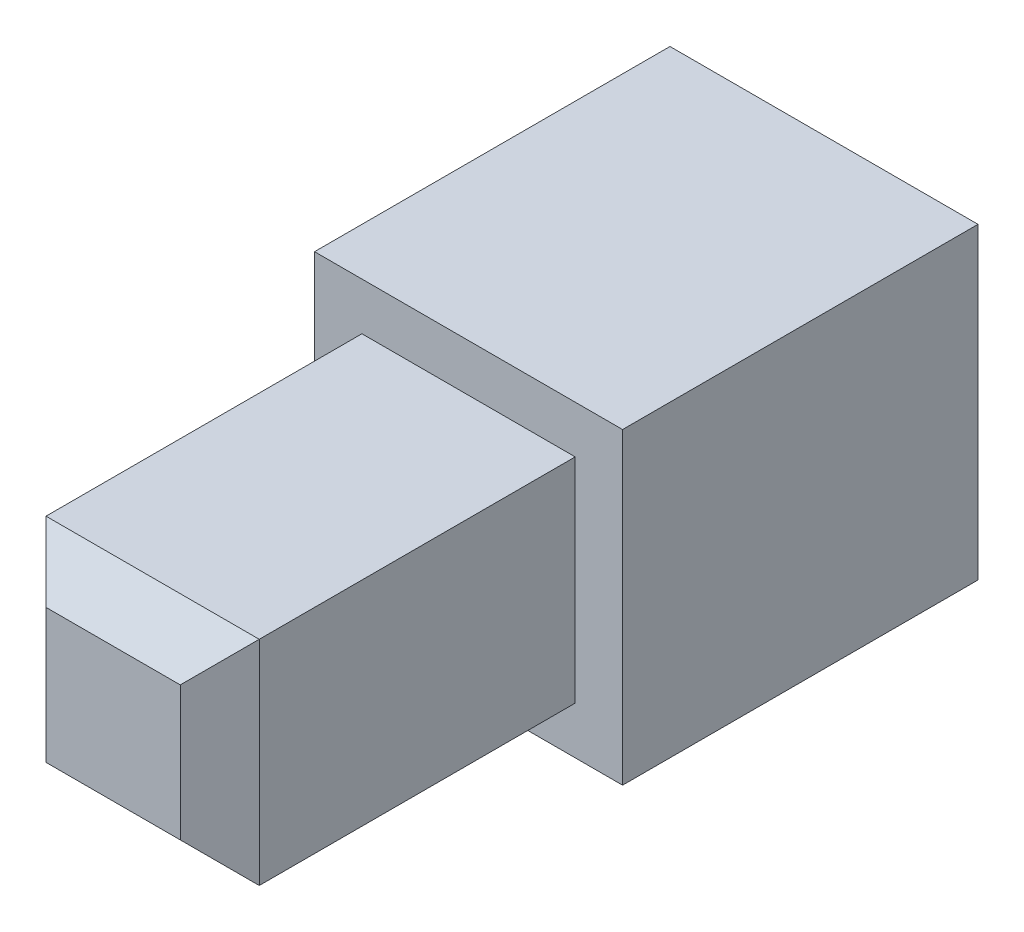
ISO-10303-21;
HEADER;
FILE_DESCRIPTION(('STEP AP214'),'2;1');
FILE_NAME('part.step','',(''),(''),'','','');
FILE_SCHEMA(('AUTOMOTIVE_DESIGN { 1 0 10303 214 1 1 1 1 }'));
ENDSEC;
DATA;
#1=APPLICATION_CONTEXT('core data for automotive mechanical design processes');
#2=APPLICATION_PROTOCOL_DEFINITION('international standard','automotive_design',2000,#1);
#3=PRODUCT_CONTEXT('',#1,'mechanical');
#4=PRODUCT('Part','Part','',(#3));
#5=PRODUCT_RELATED_PRODUCT_CATEGORY('part','',(#4));
#6=PRODUCT_DEFINITION_FORMATION('','',#4);
#7=PRODUCT_DEFINITION_CONTEXT('part definition',#1,'design');
#8=PRODUCT_DEFINITION('design','',#6,#7);
#9=PRODUCT_DEFINITION_SHAPE('','',#8);
#10=(LENGTH_UNIT() NAMED_UNIT(*) SI_UNIT(.MILLI.,.METRE.));
#11=(NAMED_UNIT(*) PLANE_ANGLE_UNIT() SI_UNIT($,.RADIAN.));
#12=(NAMED_UNIT(*) SI_UNIT($,.STERADIAN.) SOLID_ANGLE_UNIT());
#13=UNCERTAINTY_MEASURE_WITH_UNIT(LENGTH_MEASURE(1.E-05),#10,'distance_accuracy_value','');
#14=(GEOMETRIC_REPRESENTATION_CONTEXT(3) GLOBAL_UNCERTAINTY_ASSIGNED_CONTEXT((#13)) GLOBAL_UNIT_ASSIGNED_CONTEXT((#10,
#11,#12)) REPRESENTATION_CONTEXT('',''));
#15=CARTESIAN_POINT('',(0.,0.,0.));
#16=DIRECTION('',(0.,0.,1.));
#17=DIRECTION('',(1.,0.,0.));
#18=AXIS2_PLACEMENT_3D('',#15,#16,#17);
#19=CARTESIAN_POINT('',(-16.0508047809622,93.9158491987574,105.335422766237));
#20=DIRECTION('',(1.,0.,0.));
#21=DIRECTION('',(0.,0.,-1.));
#22=AXIS2_PLACEMENT_3D('',#19,#20,#21);
#23=PLANE('',#22);
#24=DIRECTION('',(0.,0.,-1.));
#25=VECTOR('',#24,1.);
#26=CARTESIAN_POINT('',(-16.0508047809622,93.9158491987574,105.335422766237));
#27=LINE('',#26,#25);
#28=CARTESIAN_POINT('',(-16.0508047809622,93.9158491987574,105.335422766237));
#29=VERTEX_POINT('',#28);
#30=CARTESIAN_POINT('',(-16.0508047809622,93.9158491987574,96.3354227662368));
#31=VERTEX_POINT('',#30);
#32=EDGE_CURVE('E216',#29,#31,#27,.T.);
#33=ORIENTED_EDGE('',*,*,#32,.T.);
#34=DIRECTION('',(0.,1.,0.));
#35=VECTOR('',#34,1.);
#36=CARTESIAN_POINT('',(-16.0508047809622,93.9158491987574,96.3354227662368));
#37=LINE('',#36,#35);
#38=CARTESIAN_POINT('',(-16.0508047809622,86.1158493894914,96.3354227662368));
#39=VERTEX_POINT('',#38);
#40=EDGE_CURVE('E204',#39,#31,#37,.T.);
#41=ORIENTED_EDGE('',*,*,#40,.F.);
#42=DIRECTION('',(0.,0.,-1.));
#43=VECTOR('',#42,1.);
#44=CARTESIAN_POINT('',(-16.0508047809622,86.1158493894914,105.335422766237));
#45=LINE('',#44,#43);
#46=CARTESIAN_POINT('',(-16.0508047809622,86.1158493894914,105.335422766237));
#47=VERTEX_POINT('',#46);
#48=EDGE_CURVE('E222',#47,#39,#45,.T.);
#49=ORIENTED_EDGE('',*,*,#48,.F.);
#50=DIRECTION('',(0.,-1.,0.));
#51=VECTOR('',#50,1.);
#52=CARTESIAN_POINT('',(-16.0508047809622,93.9158491987574,105.335422766237));
#53=LINE('',#52,#51);
#54=EDGE_CURVE('E207',#29,#47,#53,.T.);
#55=ORIENTED_EDGE('',*,*,#54,.F.);
#56=EDGE_LOOP('',(#33,#41,#49,#55));
#57=FACE_BOUND('',#56,.T.);
#58=ADVANCED_FACE('F35',(#57),#23,.F.);
#59=CARTESIAN_POINT('',(-16.0508047809622,86.1158493894914,105.335422766237));
#60=DIRECTION('',(0.,1.,0.));
#61=DIRECTION('',(0.,0.,1.));
#62=AXIS2_PLACEMENT_3D('',#59,#60,#61);
#63=PLANE('',#62);
#64=ORIENTED_EDGE('',*,*,#48,.T.);
#65=DIRECTION('',(-1.,0.,0.));
#66=VECTOR('',#65,1.);
#67=CARTESIAN_POINT('',(-16.0508047809622,86.1158493894914,96.3354227662368));
#68=LINE('',#67,#66);
#69=CARTESIAN_POINT('',(-8.2508049716962,86.1158493894914,96.3354227662368));
#70=VERTEX_POINT('',#69);
#71=EDGE_CURVE('E201',#70,#39,#68,.T.);
#72=ORIENTED_EDGE('',*,*,#71,.F.);
#73=DIRECTION('',(0.,0.,-1.));
#74=VECTOR('',#73,1.);
#75=CARTESIAN_POINT('',(-8.2508049716962,86.1158493894914,105.335422766237));
#76=LINE('',#75,#74);
#77=CARTESIAN_POINT('',(-8.2508049716962,86.1158493894914,105.335422766237));
#78=VERTEX_POINT('',#77);
#79=EDGE_CURVE('E220',#78,#70,#76,.T.);
#80=ORIENTED_EDGE('',*,*,#79,.F.);
#81=DIRECTION('',(1.,0.,0.));
#82=VECTOR('',#81,1.);
#83=CARTESIAN_POINT('',(-16.0508047809622,86.1158493894914,105.335422766237));
#84=LINE('',#83,#82);
#85=EDGE_CURVE('E210',#47,#78,#84,.T.);
#86=ORIENTED_EDGE('',*,*,#85,.F.);
#87=EDGE_LOOP('',(#64,#72,#80,#86));
#88=FACE_BOUND('',#87,.T.);
#89=ADVANCED_FACE('F276',(#88),#63,.F.);
#90=CARTESIAN_POINT('',(-8.2508049716962,93.9158491987574,105.335422766237));
#91=DIRECTION('',(-1.,0.,0.));
#92=DIRECTION('',(0.,0.,1.));
#93=AXIS2_PLACEMENT_3D('',#90,#91,#92);
#94=PLANE('',#93);
#95=ORIENTED_EDGE('',*,*,#79,.T.);
#96=DIRECTION('',(0.,-1.,0.));
#97=VECTOR('',#96,1.);
#98=CARTESIAN_POINT('',(-8.2508049716962,86.1158493894914,96.3354227662368));
#99=LINE('',#98,#97);
#100=CARTESIAN_POINT('',(-8.2508049716962,93.9158491987574,96.3354227662368));
#101=VERTEX_POINT('',#100);
#102=EDGE_CURVE('E198',#101,#70,#99,.T.);
#103=ORIENTED_EDGE('',*,*,#102,.F.);
#104=DIRECTION('',(0.,0.,-1.));
#105=VECTOR('',#104,1.);
#106=CARTESIAN_POINT('',(-8.2508049716962,93.9158491987574,105.335422766237));
#107=LINE('',#106,#105);
#108=CARTESIAN_POINT('',(-8.2508049716962,93.9158491987574,105.335422766237));
#109=VERTEX_POINT('',#108);
#110=EDGE_CURVE('E218',#109,#101,#107,.T.);
#111=ORIENTED_EDGE('',*,*,#110,.F.);
#112=DIRECTION('',(0.,1.,0.));
#113=VECTOR('',#112,1.);
#114=CARTESIAN_POINT('',(-8.2508049716962,93.9158491987574,105.335422766237));
#115=LINE('',#114,#113);
#116=EDGE_CURVE('E212',#78,#109,#115,.T.);
#117=ORIENTED_EDGE('',*,*,#116,.F.);
#118=EDGE_LOOP('',(#95,#103,#111,#117));
#119=FACE_BOUND('',#118,.T.);
#120=ADVANCED_FACE('F282',(#119),#94,.F.);
#121=CARTESIAN_POINT('',(-16.0508047809622,93.9158491987574,105.335422766237));
#122=DIRECTION('',(0.,-1.,0.));
#123=DIRECTION('',(0.,0.,-1.));
#124=AXIS2_PLACEMENT_3D('',#121,#122,#123);
#125=PLANE('',#124);
#126=ORIENTED_EDGE('',*,*,#110,.T.);
#127=DIRECTION('',(1.,0.,0.));
#128=VECTOR('',#127,1.);
#129=CARTESIAN_POINT('',(-8.2508049716962,93.9158491987574,96.3354227662368));
#130=LINE('',#129,#128);
#131=EDGE_CURVE('E195',#31,#101,#130,.T.);
#132=ORIENTED_EDGE('',*,*,#131,.F.);
#133=ORIENTED_EDGE('',*,*,#32,.F.);
#134=DIRECTION('',(-1.,0.,0.));
#135=VECTOR('',#134,1.);
#136=CARTESIAN_POINT('',(-16.0508047809622,93.9158491987574,105.335422766237));
#137=LINE('',#136,#135);
#138=EDGE_CURVE('E214',#109,#29,#137,.T.);
#139=ORIENTED_EDGE('',*,*,#138,.F.);
#140=EDGE_LOOP('',(#126,#132,#133,#139));
#141=FACE_BOUND('',#140,.T.);
#142=ADVANCED_FACE('F404',(#141),#125,.F.);
#143=CARTESIAN_POINT('',(0.,0.,105.335422766237));
#144=DIRECTION('',(0.,0.,1.));
#145=DIRECTION('',(1.,0.,0.));
#146=AXIS2_PLACEMENT_3D('',#143,#144,#145);
#147=PLANE('',#146);
#148=DIRECTION('',(0.,-1.,0.));
#149=VECTOR('',#148,1.);
#150=CARTESIAN_POINT('',(-14.8508047809622,92.7158491987574,105.335422766237));
#151=LINE('',#150,#149);
#152=CARTESIAN_POINT('',(-14.8508047809622,92.7158491987574,105.335422766237));
#153=VERTEX_POINT('',#152);
#154=CARTESIAN_POINT('',(-14.8508047809622,87.3158493894914,105.335422766237));
#155=VERTEX_POINT('',#154);
#156=EDGE_CURVE('E156',#153,#155,#151,.T.);
#157=ORIENTED_EDGE('',*,*,#156,.F.);
#158=DIRECTION('',(-1.,0.,0.));
#159=VECTOR('',#158,1.);
#160=CARTESIAN_POINT('',(-14.8508047809622,92.7158491987574,105.335422766237));
#161=LINE('',#160,#159);
#162=CARTESIAN_POINT('',(-9.45080497169619,92.7158491987574,105.335422766237));
#163=VERTEX_POINT('',#162);
#164=EDGE_CURVE('E153',#163,#153,#161,.T.);
#165=ORIENTED_EDGE('',*,*,#164,.F.);
#166=DIRECTION('',(0.,1.,0.));
#167=VECTOR('',#166,1.);
#168=CARTESIAN_POINT('',(-9.45080497169619,92.7158491987574,105.335422766237));
#169=LINE('',#168,#167);
#170=CARTESIAN_POINT('',(-9.45080497169619,87.3158493894914,105.335422766237));
#171=VERTEX_POINT('',#170);
#172=EDGE_CURVE('E139',#171,#163,#169,.T.);
#173=ORIENTED_EDGE('',*,*,#172,.F.);
#174=DIRECTION('',(1.,0.,0.));
#175=VECTOR('',#174,1.);
#176=CARTESIAN_POINT('',(-14.8508047809622,87.3158493894914,105.335422766237));
#177=LINE('',#176,#175);
#178=EDGE_CURVE('E150',#155,#171,#177,.T.);
#179=ORIENTED_EDGE('',*,*,#178,.F.);
#180=EDGE_LOOP('',(#157,#165,#173,#179));
#181=FACE_BOUND('',#180,.T.);
#182=ORIENTED_EDGE('',*,*,#54,.T.);
#183=ORIENTED_EDGE('',*,*,#85,.T.);
#184=ORIENTED_EDGE('',*,*,#116,.T.);
#185=ORIENTED_EDGE('',*,*,#138,.T.);
#186=EDGE_LOOP('',(#182,#183,#184,#185));
#187=FACE_BOUND('',#186,.T.);
#188=ADVANCED_FACE('F148',(#181,#187),#147,.T.);
#189=CARTESIAN_POINT('',(0.,0.,96.3354227662368));
#190=DIRECTION('',(0.,0.,1.));
#191=DIRECTION('',(1.,0.,0.));
#192=AXIS2_PLACEMENT_3D('',#189,#190,#191);
#193=PLANE('',#192);
#194=ORIENTED_EDGE('',*,*,#131,.T.);
#195=ORIENTED_EDGE('',*,*,#102,.T.);
#196=ORIENTED_EDGE('',*,*,#71,.T.);
#197=ORIENTED_EDGE('',*,*,#40,.T.);
#198=EDGE_LOOP('',(#194,#195,#196,#197));
#199=FACE_BOUND('',#198,.T.);
#200=DIRECTION('',(0.,-1.,0.));
#201=VECTOR('',#200,1.);
#202=CARTESIAN_POINT('',(-9.0508049716962,86.9158493894914,96.3354227662368));
#203=LINE('',#202,#201);
#204=CARTESIAN_POINT('',(-9.0508049716962,93.1158491987574,96.3354227662368));
#205=VERTEX_POINT('',#204);
#206=CARTESIAN_POINT('',(-9.0508049716962,86.9158493894914,96.3354227662368));
#207=VERTEX_POINT('',#206);
#208=EDGE_CURVE('E166',#205,#207,#203,.T.);
#209=ORIENTED_EDGE('',*,*,#208,.F.);
#210=DIRECTION('',(1.,0.,0.));
#211=VECTOR('',#210,1.);
#212=CARTESIAN_POINT('',(-9.0508049716962,93.1158491987574,96.3354227662368));
#213=LINE('',#212,#211);
#214=CARTESIAN_POINT('',(-15.2508047809622,93.1158491987574,96.3354227662368));
#215=VERTEX_POINT('',#214);
#216=EDGE_CURVE('E174',#215,#205,#213,.T.);
#217=ORIENTED_EDGE('',*,*,#216,.F.);
#218=DIRECTION('',(0.,1.,0.));
#219=VECTOR('',#218,1.);
#220=CARTESIAN_POINT('',(-15.2508047809622,93.1158491987574,96.3354227662368));
#221=LINE('',#220,#219);
#222=CARTESIAN_POINT('',(-15.2508047809622,86.9158493894914,96.3354227662368));
#223=VERTEX_POINT('',#222);
#224=EDGE_CURVE('E171',#223,#215,#221,.T.);
#225=ORIENTED_EDGE('',*,*,#224,.F.);
#226=DIRECTION('',(-1.,0.,0.));
#227=VECTOR('',#226,1.);
#228=CARTESIAN_POINT('',(-15.2508047809622,86.9158493894914,96.3354227662368));
#229=LINE('',#228,#227);
#230=EDGE_CURVE('E168',#207,#223,#229,.T.);
#231=ORIENTED_EDGE('',*,*,#230,.F.);
#232=EDGE_LOOP('',(#209,#217,#225,#231));
#233=FACE_BOUND('',#232,.T.);
#234=ADVANCED_FACE('F391',(#199,#233),#193,.F.);
#235=CARTESIAN_POINT('',(-9.0508049716962,86.9158493894914,96.3354227662368));
#236=DIRECTION('',(-1.,0.,0.));
#237=DIRECTION('',(0.,0.,1.));
#238=AXIS2_PLACEMENT_3D('',#235,#236,#237);
#239=PLANE('',#238);
#240=DIRECTION('',(0.,-1.,0.));
#241=VECTOR('',#240,1.);
#242=CARTESIAN_POINT('',(-9.0508049716962,86.9158493894914,100.335422766237));
#243=LINE('',#242,#241);
#244=CARTESIAN_POINT('',(-9.0508049716962,93.1158491987574,100.335422766237));
#245=VERTEX_POINT('',#244);
#246=CARTESIAN_POINT('',(-9.0508049716962,86.9158493894914,100.335422766237));
#247=VERTEX_POINT('',#246);
#248=EDGE_CURVE('E165',#245,#247,#243,.T.);
#249=ORIENTED_EDGE('',*,*,#248,.F.);
#250=DIRECTION('',(0.,0.,1.));
#251=VECTOR('',#250,1.);
#252=CARTESIAN_POINT('',(-9.0508049716962,93.1158491987574,96.3354227662368));
#253=LINE('',#252,#251);
#254=EDGE_CURVE('E176',#205,#245,#253,.T.);
#255=ORIENTED_EDGE('',*,*,#254,.F.);
#256=ORIENTED_EDGE('',*,*,#208,.T.);
#257=DIRECTION('',(0.,0.,1.));
#258=VECTOR('',#257,1.);
#259=CARTESIAN_POINT('',(-9.0508049716962,86.9158493894914,96.3354227662368));
#260=LINE('',#259,#258);
#261=EDGE_CURVE('E192',#207,#247,#260,.T.);
#262=ORIENTED_EDGE('',*,*,#261,.T.);
#263=EDGE_LOOP('',(#249,#255,#256,#262));
#264=FACE_BOUND('',#263,.T.);
#265=ADVANCED_FACE('F382',(#264),#239,.T.);
#266=CARTESIAN_POINT('',(-15.2508047809622,86.9158493894914,96.3354227662368));
#267=DIRECTION('',(0.,1.,0.));
#268=DIRECTION('',(0.,0.,1.));
#269=AXIS2_PLACEMENT_3D('',#266,#267,#268);
#270=PLANE('',#269);
#271=DIRECTION('',(-1.,0.,0.));
#272=VECTOR('',#271,1.);
#273=CARTESIAN_POINT('',(-15.2508047809622,86.9158493894914,100.335422766237));
#274=LINE('',#273,#272);
#275=CARTESIAN_POINT('',(-15.2508047809622,86.9158493894914,100.335422766237));
#276=VERTEX_POINT('',#275);
#277=EDGE_CURVE('E179',#247,#276,#274,.T.);
#278=ORIENTED_EDGE('',*,*,#277,.F.);
#279=ORIENTED_EDGE('',*,*,#261,.F.);
#280=ORIENTED_EDGE('',*,*,#230,.T.);
#281=DIRECTION('',(0.,0.,1.));
#282=VECTOR('',#281,1.);
#283=CARTESIAN_POINT('',(-15.2508047809622,86.9158493894914,96.3354227662368));
#284=LINE('',#283,#282);
#285=EDGE_CURVE('E190',#223,#276,#284,.T.);
#286=ORIENTED_EDGE('',*,*,#285,.T.);
#287=EDGE_LOOP('',(#278,#279,#280,#286));
#288=FACE_BOUND('',#287,.T.);
#289=ADVANCED_FACE('F373',(#288),#270,.T.);
#290=CARTESIAN_POINT('',(-15.2508047809622,93.1158491987574,96.3354227662368));
#291=DIRECTION('',(1.,0.,0.));
#292=DIRECTION('',(0.,0.,-1.));
#293=AXIS2_PLACEMENT_3D('',#290,#291,#292);
#294=PLANE('',#293);
#295=DIRECTION('',(0.,1.,0.));
#296=VECTOR('',#295,1.);
#297=CARTESIAN_POINT('',(-15.2508047809622,93.1158491987574,100.335422766237));
#298=LINE('',#297,#296);
#299=CARTESIAN_POINT('',(-15.2508047809622,93.1158491987574,100.335422766237));
#300=VERTEX_POINT('',#299);
#301=EDGE_CURVE('E182',#276,#300,#298,.T.);
#302=ORIENTED_EDGE('',*,*,#301,.F.);
#303=ORIENTED_EDGE('',*,*,#285,.F.);
#304=ORIENTED_EDGE('',*,*,#224,.T.);
#305=DIRECTION('',(0.,0.,1.));
#306=VECTOR('',#305,1.);
#307=CARTESIAN_POINT('',(-15.2508047809622,93.1158491987574,96.3354227662368));
#308=LINE('',#307,#306);
#309=EDGE_CURVE('E188',#215,#300,#308,.T.);
#310=ORIENTED_EDGE('',*,*,#309,.T.);
#311=EDGE_LOOP('',(#302,#303,#304,#310));
#312=FACE_BOUND('',#311,.T.);
#313=ADVANCED_FACE('F363',(#312),#294,.T.);
#314=CARTESIAN_POINT('',(-9.0508049716962,93.1158491987574,96.3354227662368));
#315=DIRECTION('',(0.,-1.,0.));
#316=DIRECTION('',(0.,0.,-1.));
#317=AXIS2_PLACEMENT_3D('',#314,#315,#316);
#318=PLANE('',#317);
#319=DIRECTION('',(1.,0.,0.));
#320=VECTOR('',#319,1.);
#321=CARTESIAN_POINT('',(-9.0508049716962,93.1158491987574,100.335422766237));
#322=LINE('',#321,#320);
#323=EDGE_CURVE('E169',#300,#245,#322,.T.);
#324=ORIENTED_EDGE('',*,*,#323,.F.);
#325=ORIENTED_EDGE('',*,*,#309,.F.);
#326=ORIENTED_EDGE('',*,*,#216,.T.);
#327=ORIENTED_EDGE('',*,*,#254,.T.);
#328=EDGE_LOOP('',(#324,#325,#326,#327));
#329=FACE_BOUND('',#328,.T.);
#330=ADVANCED_FACE('F357',(#329),#318,.T.);
#331=CARTESIAN_POINT('',(0.,0.,100.335422766237));
#332=DIRECTION('',(0.,0.,1.));
#333=DIRECTION('',(1.,0.,0.));
#334=AXIS2_PLACEMENT_3D('',#331,#332,#333);
#335=PLANE('',#334);
#336=ORIENTED_EDGE('',*,*,#323,.T.);
#337=ORIENTED_EDGE('',*,*,#248,.T.);
#338=ORIENTED_EDGE('',*,*,#277,.T.);
#339=ORIENTED_EDGE('',*,*,#301,.T.);
#340=EDGE_LOOP('',(#336,#337,#338,#339));
#341=FACE_BOUND('',#340,.T.);
#342=ADVANCED_FACE('F353',(#341),#335,.F.);
#343=CARTESIAN_POINT('',(-14.8508047809622,92.7158491987574,114.335422766237));
#344=DIRECTION('',(1.,0.,0.));
#345=DIRECTION('',(0.,0.,-1.));
#346=AXIS2_PLACEMENT_3D('',#343,#344,#345);
#347=PLANE('',#346);
#348=DIRECTION('',(0.,0.,-1.));
#349=VECTOR('',#348,1.);
#350=CARTESIAN_POINT('',(-14.8508047809622,87.3158493894914,114.335422766237));
#351=LINE('',#350,#349);
#352=CARTESIAN_POINT('',(-14.8508047809622,87.3158493894914,113.335422766237));
#353=VERTEX_POINT('',#352);
#354=EDGE_CURVE('E141',#353,#155,#351,.T.);
#355=ORIENTED_EDGE('',*,*,#354,.F.);
#356=DIRECTION('',(0.,1.,0.));
#357=VECTOR('',#356,1.);
#358=CARTESIAN_POINT('',(-14.8508047809622,92.7158491987574,113.335422766237));
#359=LINE('',#358,#357);
#360=CARTESIAN_POINT('',(-14.8508047809622,92.7158491987574,113.335422766237));
#361=VERTEX_POINT('',#360);
#362=EDGE_CURVE('E11',#353,#361,#359,.T.);
#363=ORIENTED_EDGE('',*,*,#362,.T.);
#364=DIRECTION('',(0.,0.,-1.));
#365=VECTOR('',#364,1.);
#366=CARTESIAN_POINT('',(-14.8508047809622,92.7158491987574,114.335422766237));
#367=LINE('',#366,#365);
#368=EDGE_CURVE('E161',#361,#153,#367,.T.);
#369=ORIENTED_EDGE('',*,*,#368,.T.);
#370=ORIENTED_EDGE('',*,*,#156,.T.);
#371=EDGE_LOOP('',(#355,#363,#369,#370));
#372=FACE_BOUND('',#371,.T.);
#373=ADVANCED_FACE('F259',(#372),#347,.F.);
#374=CARTESIAN_POINT('',(-14.8508047809622,87.3158493894914,114.335422766237));
#375=DIRECTION('',(0.,1.,0.));
#376=DIRECTION('',(0.,0.,1.));
#377=AXIS2_PLACEMENT_3D('',#374,#375,#376);
#378=PLANE('',#377);
#379=DIRECTION('',(0.,0.,-1.));
#380=VECTOR('',#379,1.);
#381=CARTESIAN_POINT('',(-9.45080497169619,87.3158493894914,114.335422766237));
#382=LINE('',#381,#380);
#383=CARTESIAN_POINT('',(-9.45080497169619,87.3158493894914,113.335422766237));
#384=VERTEX_POINT('',#383);
#385=EDGE_CURVE('E136',#384,#171,#382,.T.);
#386=ORIENTED_EDGE('',*,*,#385,.F.);
#387=DIRECTION('',(-1.,0.,0.));
#388=VECTOR('',#387,1.);
#389=CARTESIAN_POINT('',(-14.8508047809622,87.3158493894914,113.335422766237));
#390=LINE('',#389,#388);
#391=EDGE_CURVE('E45',#384,#353,#390,.T.);
#392=ORIENTED_EDGE('',*,*,#391,.T.);
#393=ORIENTED_EDGE('',*,*,#354,.T.);
#394=ORIENTED_EDGE('',*,*,#178,.T.);
#395=EDGE_LOOP('',(#386,#392,#393,#394));
#396=FACE_BOUND('',#395,.T.);
#397=ADVANCED_FACE('F155',(#396),#378,.F.);
#398=CARTESIAN_POINT('',(-9.45080497169619,92.7158491987574,114.335422766237));
#399=DIRECTION('',(-1.,0.,0.));
#400=DIRECTION('',(0.,-1.,0.));
#401=AXIS2_PLACEMENT_3D('',#398,#399,#400);
#402=PLANE('',#401);
#403=DIRECTION('',(0.,0.,-1.));
#404=VECTOR('',#403,1.);
#405=CARTESIAN_POINT('',(-9.45080497169619,92.7158491987574,114.335422766237));
#406=LINE('',#405,#404);
#407=CARTESIAN_POINT('',(-9.45080497169619,92.7158491987574,113.335422766237));
#408=VERTEX_POINT('',#407);
#409=EDGE_CURVE('E142',#408,#163,#406,.T.);
#410=ORIENTED_EDGE('',*,*,#409,.F.);
#411=DIRECTION('',(0.,-1.,0.));
#412=VECTOR('',#411,1.);
#413=CARTESIAN_POINT('',(-9.45080497169619,87.3158493894914,113.335422766237));
#414=LINE('',#413,#412);
#415=EDGE_CURVE('E60',#408,#384,#414,.T.);
#416=ORIENTED_EDGE('',*,*,#415,.T.);
#417=ORIENTED_EDGE('',*,*,#385,.T.);
#418=ORIENTED_EDGE('',*,*,#172,.T.);
#419=EDGE_LOOP('',(#410,#416,#417,#418));
#420=FACE_BOUND('',#419,.T.);
#421=ADVANCED_FACE('F138',(#420),#402,.F.);
#422=CARTESIAN_POINT('',(-14.8508047809622,92.7158491987574,114.335422766237));
#423=DIRECTION('',(0.,-1.,0.));
#424=DIRECTION('',(0.,0.,-1.));
#425=AXIS2_PLACEMENT_3D('',#422,#423,#424);
#426=PLANE('',#425);
#427=ORIENTED_EDGE('',*,*,#368,.F.);
#428=DIRECTION('',(1.,0.,0.));
#429=VECTOR('',#428,1.);
#430=CARTESIAN_POINT('',(-9.45080497169619,92.7158491987574,113.335422766237));
#431=LINE('',#430,#429);
#432=EDGE_CURVE('E233',#361,#408,#431,.T.);
#433=ORIENTED_EDGE('',*,*,#432,.T.);
#434=ORIENTED_EDGE('',*,*,#409,.T.);
#435=ORIENTED_EDGE('',*,*,#164,.T.);
#436=EDGE_LOOP('',(#427,#433,#434,#435));
#437=FACE_BOUND('',#436,.T.);
#438=ADVANCED_FACE('F262',(#437),#426,.F.);
#439=CARTESIAN_POINT('',(0.,0.,114.335422766237));
#440=DIRECTION('',(0.,0.,1.));
#441=DIRECTION('',(1.,0.,0.));
#442=AXIS2_PLACEMENT_3D('',#439,#440,#441);
#443=PLANE('',#442);
#444=DIRECTION('',(0.,1.,0.));
#445=VECTOR('',#444,1.);
#446=CARTESIAN_POINT('',(-10.4508049716962,92.7158491987574,114.335422766237));
#447=LINE('',#446,#445);
#448=CARTESIAN_POINT('',(-10.4508049716962,88.3158493894914,114.335422766237));
#449=VERTEX_POINT('',#448);
#450=CARTESIAN_POINT('',(-10.4508049716962,91.7158491987574,114.335422766237));
#451=VERTEX_POINT('',#450);
#452=EDGE_CURVE('E228',#449,#451,#447,.T.);
#453=ORIENTED_EDGE('',*,*,#452,.T.);
#454=DIRECTION('',(-1.,0.,0.));
#455=VECTOR('',#454,1.);
#456=CARTESIAN_POINT('',(-14.8508047809622,91.7158491987574,114.335422766237));
#457=LINE('',#456,#455);
#458=CARTESIAN_POINT('',(-13.8508047809622,91.7158491987574,114.335422766237));
#459=VERTEX_POINT('',#458);
#460=EDGE_CURVE('E230',#451,#459,#457,.T.);
#461=ORIENTED_EDGE('',*,*,#460,.T.);
#462=DIRECTION('',(0.,-1.,0.));
#463=VECTOR('',#462,1.);
#464=CARTESIAN_POINT('',(-13.8508047809622,87.3158493894914,114.335422766237));
#465=LINE('',#464,#463);
#466=CARTESIAN_POINT('',(-13.8508047809622,88.3158493894914,114.335422766237));
#467=VERTEX_POINT('',#466);
#468=EDGE_CURVE('E224',#459,#467,#465,.T.);
#469=ORIENTED_EDGE('',*,*,#468,.T.);
#470=DIRECTION('',(1.,0.,0.));
#471=VECTOR('',#470,1.);
#472=CARTESIAN_POINT('',(-9.45080497169619,88.3158493894914,114.335422766237));
#473=LINE('',#472,#471);
#474=EDGE_CURVE('E226',#467,#449,#473,.T.);
#475=ORIENTED_EDGE('',*,*,#474,.T.);
#476=EDGE_LOOP('',(#453,#461,#469,#475));
#477=FACE_BOUND('',#476,.T.);
#478=ADVANCED_FACE('F267',(#477),#443,.T.);
#479=CARTESIAN_POINT('',(0.,88.3158493894914,114.335422766237));
#480=DIRECTION('',(0.,-0.707106781186547,0.707106781186547));
#481=DIRECTION('',(-1.,0.,0.));
#482=AXIS2_PLACEMENT_3D('',#479,#480,#481);
#483=PLANE('',#482);
#484=DIRECTION('',(0.577350269189626,0.577350269189625,0.577350269189625));
#485=VECTOR('',#484,1.);
#486=CARTESIAN_POINT('',(-43.289421244126,58.8772329263277,84.8968063030731));
#487=LINE('',#486,#485);
#488=EDGE_CURVE('E241',#353,#467,#487,.T.);
#489=ORIENTED_EDGE('',*,*,#488,.F.);
#490=ORIENTED_EDGE('',*,*,#391,.F.);
#491=DIRECTION('',(-0.577350269189627,0.577350269189625,0.577350269189625));
#492=VECTOR('',#491,1.);
#493=CARTESIAN_POINT('',(-6.96720331446412,84.8322477322594,110.851821109005));
#494=LINE('',#493,#492);
#495=EDGE_CURVE('E40',#449,#384,#494,.F.);
#496=ORIENTED_EDGE('',*,*,#495,.F.);
#497=ORIENTED_EDGE('',*,*,#474,.F.);
#498=EDGE_LOOP('',(#489,#490,#496,#497));
#499=FACE_BOUND('',#498,.T.);
#500=ADVANCED_FACE('F38',(#499),#483,.T.);
#501=CARTESIAN_POINT('',(-10.4508049716962,0.,114.335422766237));
#502=DIRECTION('',(0.707106781186547,0.,0.707106781186548));
#503=DIRECTION('',(0.,-1.,0.));
#504=AXIS2_PLACEMENT_3D('',#501,#502,#503);
#505=PLANE('',#504);
#506=ORIENTED_EDGE('',*,*,#495,.T.);
#507=ORIENTED_EDGE('',*,*,#415,.F.);
#508=DIRECTION('',(-0.577350269189626,-0.577350269189625,0.577350269189625));
#509=VECTOR('',#508,1.);
#510=CARTESIAN_POINT('',(-41.0227547046154,61.1438994658384,144.907372499156));
#511=LINE('',#510,#509);
#512=EDGE_CURVE('E240',#451,#408,#511,.F.);
#513=ORIENTED_EDGE('',*,*,#512,.F.);
#514=ORIENTED_EDGE('',*,*,#452,.F.);
#515=EDGE_LOOP('',(#506,#507,#513,#514));
#516=FACE_BOUND('',#515,.T.);
#517=ADVANCED_FACE('F251',(#516),#505,.T.);
#518=CARTESIAN_POINT('',(-13.8508047809622,0.,114.335422766237));
#519=DIRECTION('',(-0.707106781186547,0.,0.707106781186548));
#520=DIRECTION('',(0.,1.,0.));
#521=AXIS2_PLACEMENT_3D('',#518,#519,#520);
#522=PLANE('',#521);
#523=ORIENTED_EDGE('',*,*,#488,.T.);
#524=ORIENTED_EDGE('',*,*,#468,.F.);
#525=DIRECTION('',(-0.577350269189626,0.577350269189625,-0.577350269189625));
#526=VECTOR('',#525,1.);
#527=CARTESIAN_POINT('',(16.721144951957,61.1438994658383,144.907372499156));
#528=LINE('',#527,#526);
#529=EDGE_CURVE('E238',#361,#459,#528,.F.);
#530=ORIENTED_EDGE('',*,*,#529,.F.);
#531=ORIENTED_EDGE('',*,*,#362,.F.);
#532=EDGE_LOOP('',(#523,#524,#530,#531));
#533=FACE_BOUND('',#532,.T.);
#534=ADVANCED_FACE('F256',(#533),#522,.T.);
#535=CARTESIAN_POINT('',(0.,91.7158491987574,114.335422766237));
#536=DIRECTION('',(0.,0.707106781186547,0.707106781186547));
#537=DIRECTION('',(1.,0.,0.));
#538=AXIS2_PLACEMENT_3D('',#535,#536,#537);
#539=PLANE('',#538);
#540=ORIENTED_EDGE('',*,*,#512,.T.);
#541=ORIENTED_EDGE('',*,*,#432,.F.);
#542=ORIENTED_EDGE('',*,*,#529,.T.);
#543=ORIENTED_EDGE('',*,*,#460,.F.);
#544=EDGE_LOOP('',(#540,#541,#542,#543));
#545=FACE_BOUND('',#544,.T.);
#546=ADVANCED_FACE('F264',(#545),#539,.T.);
#547=CLOSED_SHELL('',(#58,#89,#120,#142,#188,#234,#265,#289,#313,#330,#342,#373,#397,#421,#438,
#478,#500,#517,#534,#546));
#548=MANIFOLD_SOLID_BREP('B2',#547);
#549=ADVANCED_BREP_SHAPE_REPRESENTATION('',(#18,#548),#14);
#550=SHAPE_DEFINITION_REPRESENTATION(#9,#549);
ENDSEC;
END-ISO-10303-21;
